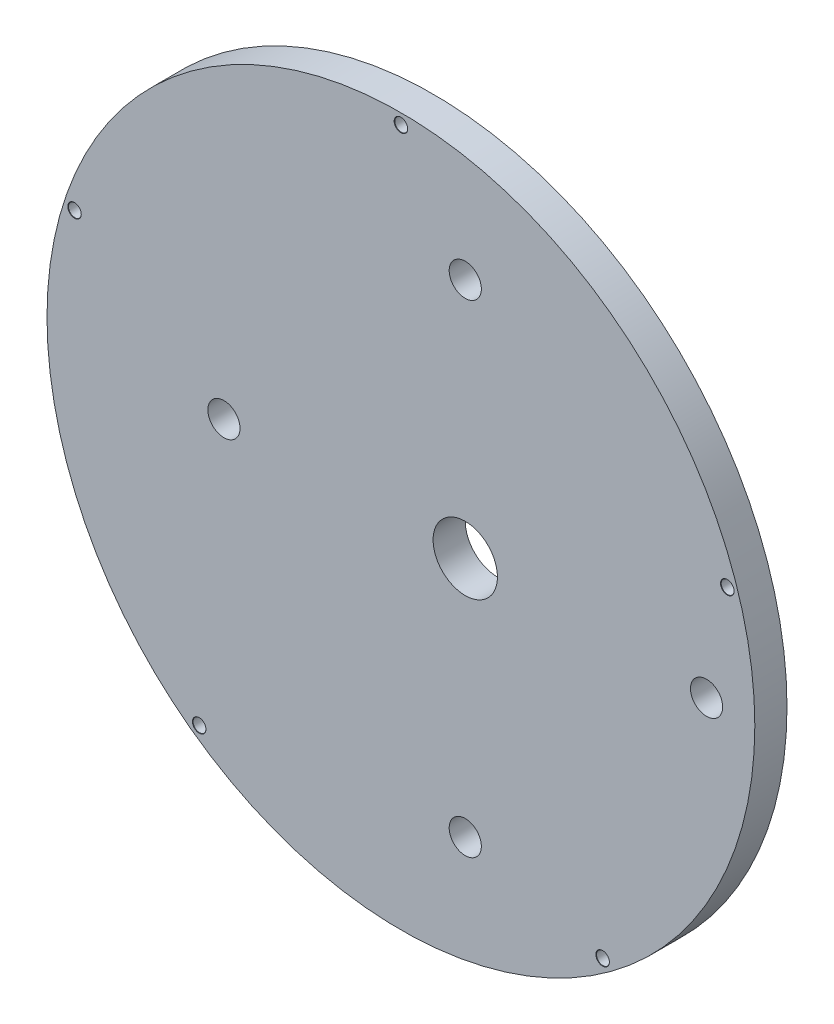
ISO-10303-21;
HEADER;
FILE_DESCRIPTION(('STEP AP214'),'2;1');
FILE_NAME('part.step','',(''),(''),'','','');
FILE_SCHEMA(('AUTOMOTIVE_DESIGN { 1 0 10303 214 1 1 1 1 }'));
ENDSEC;
DATA;
#1=APPLICATION_CONTEXT('core data for automotive mechanical design processes');
#2=APPLICATION_PROTOCOL_DEFINITION('international standard','automotive_design',2000,#1);
#3=PRODUCT_CONTEXT('',#1,'mechanical');
#4=PRODUCT('Part','Part','',(#3));
#5=PRODUCT_RELATED_PRODUCT_CATEGORY('part','',(#4));
#6=PRODUCT_DEFINITION_FORMATION('','',#4);
#7=PRODUCT_DEFINITION_CONTEXT('part definition',#1,'design');
#8=PRODUCT_DEFINITION('design','',#6,#7);
#9=PRODUCT_DEFINITION_SHAPE('','',#8);
#10=(LENGTH_UNIT() NAMED_UNIT(*) SI_UNIT(.MILLI.,.METRE.));
#11=(NAMED_UNIT(*) PLANE_ANGLE_UNIT() SI_UNIT($,.RADIAN.));
#12=(NAMED_UNIT(*) SI_UNIT($,.STERADIAN.) SOLID_ANGLE_UNIT());
#13=UNCERTAINTY_MEASURE_WITH_UNIT(LENGTH_MEASURE(1.E-05),#10,'distance_accuracy_value','');
#14=(GEOMETRIC_REPRESENTATION_CONTEXT(3) GLOBAL_UNCERTAINTY_ASSIGNED_CONTEXT((#13)) GLOBAL_UNIT_ASSIGNED_CONTEXT((#10,
#11,#12)) REPRESENTATION_CONTEXT('',''));
#15=CARTESIAN_POINT('',(0.,0.,0.));
#16=DIRECTION('',(0.,0.,1.));
#17=DIRECTION('',(1.,0.,0.));
#18=AXIS2_PLACEMENT_3D('',#15,#16,#17);
#19=CARTESIAN_POINT('',(0.,0.,1.25));
#20=DIRECTION('',(0.,0.,-1.));
#21=DIRECTION('',(-1.,0.,0.));
#22=AXIS2_PLACEMENT_3D('',#19,#20,#21);
#23=CYLINDRICAL_SURFACE('',#22,27.5);
#24=CARTESIAN_POINT('',(0.,0.,1.25));
#25=DIRECTION('',(0.,0.,1.));
#26=DIRECTION('',(1.,0.,0.));
#27=AXIS2_PLACEMENT_3D('',#24,#25,#26);
#28=CIRCLE('',#27,27.5);
#29=CARTESIAN_POINT('',(27.5,0.,1.25));
#30=VERTEX_POINT('',#29);
#31=EDGE_CURVE('E10',#30,#30,#28,.T.);
#32=ORIENTED_EDGE('',*,*,#31,.F.);
#33=EDGE_LOOP('',(#32));
#34=FACE_BOUND('',#33,.T.);
#35=CARTESIAN_POINT('',(0.,0.,-1.25));
#36=DIRECTION('',(0.,0.,1.));
#37=DIRECTION('',(1.,0.,0.));
#38=AXIS2_PLACEMENT_3D('',#35,#36,#37);
#39=CIRCLE('',#38,27.5);
#40=CARTESIAN_POINT('',(27.5,0.,-1.25));
#41=VERTEX_POINT('',#40);
#42=EDGE_CURVE('E38',#41,#41,#39,.T.);
#43=ORIENTED_EDGE('',*,*,#42,.T.);
#44=EDGE_LOOP('',(#43));
#45=FACE_BOUND('',#44,.T.);
#46=ADVANCED_FACE('F35',(#34,#45),#23,.T.);
#47=CARTESIAN_POINT('',(0.,0.,1.25));
#48=DIRECTION('',(0.,0.,1.));
#49=DIRECTION('',(1.,0.,0.));
#50=AXIS2_PLACEMENT_3D('',#47,#48,#49);
#51=PLANE('',#50);
#52=CARTESIAN_POINT('',(25.361507101204,8.24045318333222,1.25));
#53=DIRECTION('',(0.,0.,1.));
#54=DIRECTION('',(1.,0.,0.));
#55=AXIS2_PLACEMENT_3D('',#52,#53,#54);
#56=CIRCLE('',#55,0.525000000000001);
#57=CARTESIAN_POINT('',(25.886507101204,8.24045318333222,1.25));
#58=VERTEX_POINT('',#57);
#59=EDGE_CURVE('E118',#58,#58,#56,.T.);
#60=ORIENTED_EDGE('',*,*,#59,.F.);
#61=EDGE_LOOP('',(#60));
#62=FACE_BOUND('',#61,.T.);
#63=CARTESIAN_POINT('',(15.6742733944661,-21.5737865166651,1.25));
#64=DIRECTION('',(0.,0.,1.));
#65=DIRECTION('',(1.,0.,0.));
#66=AXIS2_PLACEMENT_3D('',#63,#64,#65);
#67=CIRCLE('',#66,0.525000000000001);
#68=CARTESIAN_POINT('',(16.1992733944661,-21.5737865166651,1.25));
#69=VERTEX_POINT('',#68);
#70=EDGE_CURVE('E109',#69,#69,#67,.T.);
#71=ORIENTED_EDGE('',*,*,#70,.F.);
#72=EDGE_LOOP('',(#71));
#73=FACE_BOUND('',#72,.T.);
#74=CARTESIAN_POINT('',(-15.6742733944658,-21.5737865166654,1.25));
#75=DIRECTION('',(0.,0.,1.));
#76=DIRECTION('',(1.,0.,0.));
#77=AXIS2_PLACEMENT_3D('',#74,#75,#76);
#78=CIRCLE('',#77,0.524999999999999);
#79=CARTESIAN_POINT('',(-15.1492733944658,-21.5737865166654,1.25));
#80=VERTEX_POINT('',#79);
#81=EDGE_CURVE('E100',#80,#80,#78,.T.);
#82=ORIENTED_EDGE('',*,*,#81,.F.);
#83=EDGE_LOOP('',(#82));
#84=FACE_BOUND('',#83,.T.);
#85=CARTESIAN_POINT('',(-25.3615071012041,8.24045318333186,1.25));
#86=DIRECTION('',(0.,0.,1.));
#87=DIRECTION('',(1.,0.,0.));
#88=AXIS2_PLACEMENT_3D('',#85,#86,#87);
#89=CIRCLE('',#88,0.524999999999998);
#90=CARTESIAN_POINT('',(-24.8365071012041,8.24045318333186,1.25));
#91=VERTEX_POINT('',#90);
#92=EDGE_CURVE('E91',#91,#91,#89,.T.);
#93=ORIENTED_EDGE('',*,*,#92,.F.);
#94=EDGE_LOOP('',(#93));
#95=FACE_BOUND('',#94,.T.);
#96=CARTESIAN_POINT('',(0.,26.6666666666667,1.25));
#97=DIRECTION('',(0.,0.,1.));
#98=DIRECTION('',(1.,0.,0.));
#99=AXIS2_PLACEMENT_3D('',#96,#97,#98);
#100=CIRCLE('',#99,0.524999999999999);
#101=CARTESIAN_POINT('',(0.525,26.6666666666667,1.25));
#102=VERTEX_POINT('',#101);
#103=EDGE_CURVE('E82',#102,#102,#100,.T.);
#104=ORIENTED_EDGE('',*,*,#103,.F.);
#105=EDGE_LOOP('',(#104));
#106=FACE_BOUND('',#105,.T.);
#107=CARTESIAN_POINT('',(5.,18.75,1.25));
#108=DIRECTION('',(0.,0.,1.));
#109=DIRECTION('',(1.,0.,0.));
#110=AXIS2_PLACEMENT_3D('',#107,#108,#109);
#111=CIRCLE('',#110,1.25);
#112=CARTESIAN_POINT('',(6.25,18.75,1.25));
#113=VERTEX_POINT('',#112);
#114=EDGE_CURVE('E45',#113,#113,#111,.T.);
#115=ORIENTED_EDGE('',*,*,#114,.F.);
#116=EDGE_LOOP('',(#115));
#117=FACE_BOUND('',#116,.T.);
#118=CARTESIAN_POINT('',(-13.75,0.,1.25));
#119=DIRECTION('',(0.,0.,1.));
#120=DIRECTION('',(1.,0.,0.));
#121=AXIS2_PLACEMENT_3D('',#118,#119,#120);
#122=CIRCLE('',#121,1.25);
#123=CARTESIAN_POINT('',(-12.5,0.,1.25));
#124=VERTEX_POINT('',#123);
#125=EDGE_CURVE('E49',#124,#124,#122,.T.);
#126=ORIENTED_EDGE('',*,*,#125,.F.);
#127=EDGE_LOOP('',(#126));
#128=FACE_BOUND('',#127,.T.);
#129=CARTESIAN_POINT('',(23.75,0.,1.25));
#130=DIRECTION('',(0.,0.,1.));
#131=DIRECTION('',(1.,0.,0.));
#132=AXIS2_PLACEMENT_3D('',#129,#130,#131);
#133=CIRCLE('',#132,1.25);
#134=CARTESIAN_POINT('',(25.,0.,1.25));
#135=VERTEX_POINT('',#134);
#136=EDGE_CURVE('E52',#135,#135,#133,.T.);
#137=ORIENTED_EDGE('',*,*,#136,.F.);
#138=EDGE_LOOP('',(#137));
#139=FACE_BOUND('',#138,.T.);
#140=CARTESIAN_POINT('',(5.,-18.75,1.25));
#141=DIRECTION('',(0.,0.,1.));
#142=DIRECTION('',(1.,0.,0.));
#143=AXIS2_PLACEMENT_3D('',#140,#141,#142);
#144=CIRCLE('',#143,1.25);
#145=CARTESIAN_POINT('',(6.25,-18.75,1.25));
#146=VERTEX_POINT('',#145);
#147=EDGE_CURVE('E55',#146,#146,#144,.T.);
#148=ORIENTED_EDGE('',*,*,#147,.F.);
#149=EDGE_LOOP('',(#148));
#150=FACE_BOUND('',#149,.T.);
#151=CARTESIAN_POINT('',(5.,0.,1.25));
#152=DIRECTION('',(0.,0.,1.));
#153=DIRECTION('',(1.,0.,0.));
#154=AXIS2_PLACEMENT_3D('',#151,#152,#153);
#155=CIRCLE('',#154,2.5);
#156=CARTESIAN_POINT('',(7.5,0.,1.25));
#157=VERTEX_POINT('',#156);
#158=EDGE_CURVE('E58',#157,#157,#155,.T.);
#159=ORIENTED_EDGE('',*,*,#158,.F.);
#160=EDGE_LOOP('',(#159));
#161=FACE_BOUND('',#160,.T.);
#162=ORIENTED_EDGE('',*,*,#31,.T.);
#163=EDGE_LOOP('',(#162));
#164=FACE_BOUND('',#163,.T.);
#165=ADVANCED_FACE('F124',(#62,#73,#84,#95,#106,#117,#128,#139,#150,#161,#164),#51,.T.);
#166=CARTESIAN_POINT('',(0.,0.,-1.25));
#167=DIRECTION('',(0.,0.,1.));
#168=DIRECTION('',(1.,0.,0.));
#169=AXIS2_PLACEMENT_3D('',#166,#167,#168);
#170=PLANE('',#169);
#171=CARTESIAN_POINT('',(25.361507101204,8.24045318333222,-1.25));
#172=DIRECTION('',(0.,0.,1.));
#173=DIRECTION('',(1.,0.,0.));
#174=AXIS2_PLACEMENT_3D('',#171,#172,#173);
#175=CIRCLE('',#174,0.5);
#176=CARTESIAN_POINT('',(25.861507101204,8.24045318333222,-1.25));
#177=VERTEX_POINT('',#176);
#178=EDGE_CURVE('E112',#177,#177,#175,.T.);
#179=ORIENTED_EDGE('',*,*,#178,.T.);
#180=EDGE_LOOP('',(#179));
#181=FACE_BOUND('',#180,.T.);
#182=CARTESIAN_POINT('',(15.6742733944661,-21.5737865166651,-1.25));
#183=DIRECTION('',(0.,0.,1.));
#184=DIRECTION('',(1.,0.,0.));
#185=AXIS2_PLACEMENT_3D('',#182,#183,#184);
#186=CIRCLE('',#185,0.5);
#187=CARTESIAN_POINT('',(16.1742733944661,-21.5737865166651,-1.25));
#188=VERTEX_POINT('',#187);
#189=EDGE_CURVE('E103',#188,#188,#186,.T.);
#190=ORIENTED_EDGE('',*,*,#189,.T.);
#191=EDGE_LOOP('',(#190));
#192=FACE_BOUND('',#191,.T.);
#193=CARTESIAN_POINT('',(-15.6742733944658,-21.5737865166654,-1.25));
#194=DIRECTION('',(0.,0.,1.));
#195=DIRECTION('',(1.,0.,0.));
#196=AXIS2_PLACEMENT_3D('',#193,#194,#195);
#197=CIRCLE('',#196,0.5);
#198=CARTESIAN_POINT('',(-15.1742733944658,-21.5737865166654,-1.25));
#199=VERTEX_POINT('',#198);
#200=EDGE_CURVE('E94',#199,#199,#197,.T.);
#201=ORIENTED_EDGE('',*,*,#200,.T.);
#202=EDGE_LOOP('',(#201));
#203=FACE_BOUND('',#202,.T.);
#204=CARTESIAN_POINT('',(-25.3615071012041,8.24045318333186,-1.25));
#205=DIRECTION('',(0.,0.,1.));
#206=DIRECTION('',(1.,0.,0.));
#207=AXIS2_PLACEMENT_3D('',#204,#205,#206);
#208=CIRCLE('',#207,0.5);
#209=CARTESIAN_POINT('',(-24.8615071012041,8.24045318333186,-1.25));
#210=VERTEX_POINT('',#209);
#211=EDGE_CURVE('E85',#210,#210,#208,.T.);
#212=ORIENTED_EDGE('',*,*,#211,.T.);
#213=EDGE_LOOP('',(#212));
#214=FACE_BOUND('',#213,.T.);
#215=CARTESIAN_POINT('',(0.,26.6666666666667,-1.25));
#216=DIRECTION('',(0.,0.,1.));
#217=DIRECTION('',(1.,0.,0.));
#218=AXIS2_PLACEMENT_3D('',#215,#216,#217);
#219=CIRCLE('',#218,0.5);
#220=CARTESIAN_POINT('',(0.5,26.6666666666667,-1.25));
#221=VERTEX_POINT('',#220);
#222=EDGE_CURVE('E74',#221,#221,#219,.T.);
#223=ORIENTED_EDGE('',*,*,#222,.T.);
#224=EDGE_LOOP('',(#223));
#225=FACE_BOUND('',#224,.T.);
#226=CARTESIAN_POINT('',(5.,18.75,-1.25));
#227=DIRECTION('',(0.,0.,1.));
#228=DIRECTION('',(1.,0.,0.));
#229=AXIS2_PLACEMENT_3D('',#226,#227,#228);
#230=CIRCLE('',#229,1.25);
#231=CARTESIAN_POINT('',(6.25,18.75,-1.25));
#232=VERTEX_POINT('',#231);
#233=EDGE_CURVE('E64',#232,#232,#230,.T.);
#234=ORIENTED_EDGE('',*,*,#233,.T.);
#235=EDGE_LOOP('',(#234));
#236=FACE_BOUND('',#235,.T.);
#237=CARTESIAN_POINT('',(-13.75,0.,-1.25));
#238=DIRECTION('',(0.,0.,1.));
#239=DIRECTION('',(1.,0.,0.));
#240=AXIS2_PLACEMENT_3D('',#237,#238,#239);
#241=CIRCLE('',#240,1.25);
#242=CARTESIAN_POINT('',(-12.5,0.,-1.25));
#243=VERTEX_POINT('',#242);
#244=EDGE_CURVE('E65',#243,#243,#241,.T.);
#245=ORIENTED_EDGE('',*,*,#244,.T.);
#246=EDGE_LOOP('',(#245));
#247=FACE_BOUND('',#246,.T.);
#248=CARTESIAN_POINT('',(23.75,0.,-1.25));
#249=DIRECTION('',(0.,0.,1.));
#250=DIRECTION('',(1.,0.,0.));
#251=AXIS2_PLACEMENT_3D('',#248,#249,#250);
#252=CIRCLE('',#251,1.25);
#253=CARTESIAN_POINT('',(25.,0.,-1.25));
#254=VERTEX_POINT('',#253);
#255=EDGE_CURVE('E68',#254,#254,#252,.T.);
#256=ORIENTED_EDGE('',*,*,#255,.T.);
#257=EDGE_LOOP('',(#256));
#258=FACE_BOUND('',#257,.T.);
#259=CARTESIAN_POINT('',(5.,-18.75,-1.25));
#260=DIRECTION('',(0.,0.,1.));
#261=DIRECTION('',(1.,0.,0.));
#262=AXIS2_PLACEMENT_3D('',#259,#260,#261);
#263=CIRCLE('',#262,1.25);
#264=CARTESIAN_POINT('',(6.25,-18.75,-1.25));
#265=VERTEX_POINT('',#264);
#266=EDGE_CURVE('E71',#265,#265,#263,.T.);
#267=ORIENTED_EDGE('',*,*,#266,.T.);
#268=EDGE_LOOP('',(#267));
#269=FACE_BOUND('',#268,.T.);
#270=CARTESIAN_POINT('',(5.,0.,-1.25));
#271=DIRECTION('',(0.,0.,1.));
#272=DIRECTION('',(1.,0.,0.));
#273=AXIS2_PLACEMENT_3D('',#270,#271,#272);
#274=CIRCLE('',#273,2.5);
#275=CARTESIAN_POINT('',(7.5,0.,-1.25));
#276=VERTEX_POINT('',#275);
#277=EDGE_CURVE('E61',#276,#276,#274,.T.);
#278=ORIENTED_EDGE('',*,*,#277,.T.);
#279=EDGE_LOOP('',(#278));
#280=FACE_BOUND('',#279,.T.);
#281=ORIENTED_EDGE('',*,*,#42,.F.);
#282=EDGE_LOOP('',(#281));
#283=FACE_BOUND('',#282,.T.);
#284=ADVANCED_FACE('F127',(#181,#192,#203,#214,#225,#236,#247,#258,#269,#280,#283),#170,.F.);
#285=CARTESIAN_POINT('',(5.,0.,-1.25));
#286=DIRECTION('',(0.,0.,1.));
#287=DIRECTION('',(1.,0.,0.));
#288=AXIS2_PLACEMENT_3D('',#285,#286,#287);
#289=CYLINDRICAL_SURFACE('',#288,2.5);
#290=ORIENTED_EDGE('',*,*,#158,.T.);
#291=EDGE_LOOP('',(#290));
#292=FACE_BOUND('',#291,.T.);
#293=ORIENTED_EDGE('',*,*,#277,.F.);
#294=EDGE_LOOP('',(#293));
#295=FACE_BOUND('',#294,.T.);
#296=ADVANCED_FACE('F147',(#292,#295),#289,.F.);
#297=CARTESIAN_POINT('',(5.,-18.75,-1.25));
#298=DIRECTION('',(0.,0.,1.));
#299=DIRECTION('',(1.,0.,0.));
#300=AXIS2_PLACEMENT_3D('',#297,#298,#299);
#301=CYLINDRICAL_SURFACE('',#300,1.25);
#302=ORIENTED_EDGE('',*,*,#147,.T.);
#303=EDGE_LOOP('',(#302));
#304=FACE_BOUND('',#303,.T.);
#305=ORIENTED_EDGE('',*,*,#266,.F.);
#306=EDGE_LOOP('',(#305));
#307=FACE_BOUND('',#306,.T.);
#308=ADVANCED_FACE('F150',(#304,#307),#301,.F.);
#309=CARTESIAN_POINT('',(23.75,0.,-1.25));
#310=DIRECTION('',(0.,0.,1.));
#311=DIRECTION('',(1.,0.,0.));
#312=AXIS2_PLACEMENT_3D('',#309,#310,#311);
#313=CYLINDRICAL_SURFACE('',#312,1.25);
#314=ORIENTED_EDGE('',*,*,#136,.T.);
#315=EDGE_LOOP('',(#314));
#316=FACE_BOUND('',#315,.T.);
#317=ORIENTED_EDGE('',*,*,#255,.F.);
#318=EDGE_LOOP('',(#317));
#319=FACE_BOUND('',#318,.T.);
#320=ADVANCED_FACE('F183',(#316,#319),#313,.F.);
#321=CARTESIAN_POINT('',(-13.75,0.,-1.25));
#322=DIRECTION('',(0.,0.,1.));
#323=DIRECTION('',(1.,0.,0.));
#324=AXIS2_PLACEMENT_3D('',#321,#322,#323);
#325=CYLINDRICAL_SURFACE('',#324,1.25);
#326=ORIENTED_EDGE('',*,*,#125,.T.);
#327=EDGE_LOOP('',(#326));
#328=FACE_BOUND('',#327,.T.);
#329=ORIENTED_EDGE('',*,*,#244,.F.);
#330=EDGE_LOOP('',(#329));
#331=FACE_BOUND('',#330,.T.);
#332=ADVANCED_FACE('F191',(#328,#331),#325,.F.);
#333=CARTESIAN_POINT('',(5.,18.75,-1.25));
#334=DIRECTION('',(0.,0.,1.));
#335=DIRECTION('',(1.,0.,0.));
#336=AXIS2_PLACEMENT_3D('',#333,#334,#335);
#337=CYLINDRICAL_SURFACE('',#336,1.25);
#338=ORIENTED_EDGE('',*,*,#114,.T.);
#339=EDGE_LOOP('',(#338));
#340=FACE_BOUND('',#339,.T.);
#341=ORIENTED_EDGE('',*,*,#233,.F.);
#342=EDGE_LOOP('',(#341));
#343=FACE_BOUND('',#342,.T.);
#344=ADVANCED_FACE('F199',(#340,#343),#337,.F.);
#345=CARTESIAN_POINT('',(0.,26.6666666666667,1.25));
#346=DIRECTION('',(0.,0.,1.));
#347=DIRECTION('',(1.,0.,0.));
#348=AXIS2_PLACEMENT_3D('',#345,#346,#347);
#349=CYLINDRICAL_SURFACE('',#348,0.5);
#350=ORIENTED_EDGE('',*,*,#222,.F.);
#351=EDGE_LOOP('',(#350));
#352=FACE_BOUND('',#351,.T.);
#353=CARTESIAN_POINT('',(0.,26.6666666666667,1.225));
#354=DIRECTION('',(0.,0.,1.));
#355=DIRECTION('',(1.,0.,0.));
#356=AXIS2_PLACEMENT_3D('',#353,#354,#355);
#357=CIRCLE('',#356,0.5);
#358=CARTESIAN_POINT('',(0.5,26.6666666666667,1.225));
#359=VERTEX_POINT('',#358);
#360=EDGE_CURVE('E79',#359,#359,#357,.T.);
#361=ORIENTED_EDGE('',*,*,#360,.T.);
#362=EDGE_LOOP('',(#361));
#363=FACE_BOUND('',#362,.T.);
#364=ADVANCED_FACE('F207',(#352,#363),#349,.F.);
#365=CARTESIAN_POINT('',(0.,26.6666666666667,1.25));
#366=DIRECTION('',(0.,0.,1.));
#367=DIRECTION('',(1.,0.,0.));
#368=AXIS2_PLACEMENT_3D('',#365,#366,#367);
#369=CONICAL_SURFACE('',#368,0.524999999999999,0.785398163397396);
#370=ORIENTED_EDGE('',*,*,#360,.F.);
#371=EDGE_LOOP('',(#370));
#372=FACE_BOUND('',#371,.T.);
#373=ORIENTED_EDGE('',*,*,#103,.T.);
#374=EDGE_LOOP('',(#373));
#375=FACE_BOUND('',#374,.T.);
#376=ADVANCED_FACE('F215',(#372,#375),#369,.F.);
#377=CARTESIAN_POINT('',(-25.3615071012041,8.24045318333186,1.25));
#378=DIRECTION('',(0.,0.,1.));
#379=DIRECTION('',(1.,0.,0.));
#380=AXIS2_PLACEMENT_3D('',#377,#378,#379);
#381=CYLINDRICAL_SURFACE('',#380,0.5);
#382=ORIENTED_EDGE('',*,*,#211,.F.);
#383=EDGE_LOOP('',(#382));
#384=FACE_BOUND('',#383,.T.);
#385=CARTESIAN_POINT('',(-25.3615071012041,8.24045318333186,1.225));
#386=DIRECTION('',(0.,0.,1.));
#387=DIRECTION('',(1.,0.,0.));
#388=AXIS2_PLACEMENT_3D('',#385,#386,#387);
#389=CIRCLE('',#388,0.5);
#390=CARTESIAN_POINT('',(-24.8615071012041,8.24045318333186,1.225));
#391=VERTEX_POINT('',#390);
#392=EDGE_CURVE('E88',#391,#391,#389,.T.);
#393=ORIENTED_EDGE('',*,*,#392,.T.);
#394=EDGE_LOOP('',(#393));
#395=FACE_BOUND('',#394,.T.);
#396=ADVANCED_FACE('F222',(#384,#395),#381,.F.);
#397=CARTESIAN_POINT('',(-25.3615071012041,8.24045318333186,1.25));
#398=DIRECTION('',(0.,0.,1.));
#399=DIRECTION('',(1.,0.,0.));
#400=AXIS2_PLACEMENT_3D('',#397,#398,#399);
#401=CONICAL_SURFACE('',#400,0.524999999999998,0.785398163397353);
#402=ORIENTED_EDGE('',*,*,#392,.F.);
#403=EDGE_LOOP('',(#402));
#404=FACE_BOUND('',#403,.T.);
#405=ORIENTED_EDGE('',*,*,#92,.T.);
#406=EDGE_LOOP('',(#405));
#407=FACE_BOUND('',#406,.T.);
#408=ADVANCED_FACE('F229',(#404,#407),#401,.F.);
#409=CARTESIAN_POINT('',(-15.6742733944658,-21.5737865166654,1.25));
#410=DIRECTION('',(0.,0.,1.));
#411=DIRECTION('',(1.,0.,0.));
#412=AXIS2_PLACEMENT_3D('',#409,#410,#411);
#413=CYLINDRICAL_SURFACE('',#412,0.5);
#414=ORIENTED_EDGE('',*,*,#200,.F.);
#415=EDGE_LOOP('',(#414));
#416=FACE_BOUND('',#415,.T.);
#417=CARTESIAN_POINT('',(-15.6742733944658,-21.5737865166654,1.225));
#418=DIRECTION('',(0.,0.,1.));
#419=DIRECTION('',(1.,0.,0.));
#420=AXIS2_PLACEMENT_3D('',#417,#418,#419);
#421=CIRCLE('',#420,0.5);
#422=CARTESIAN_POINT('',(-15.1742733944658,-21.5737865166654,1.225));
#423=VERTEX_POINT('',#422);
#424=EDGE_CURVE('E97',#423,#423,#421,.T.);
#425=ORIENTED_EDGE('',*,*,#424,.T.);
#426=EDGE_LOOP('',(#425));
#427=FACE_BOUND('',#426,.T.);
#428=ADVANCED_FACE('F237',(#416,#427),#413,.F.);
#429=CARTESIAN_POINT('',(-15.6742733944658,-21.5737865166654,1.25));
#430=DIRECTION('',(0.,0.,1.));
#431=DIRECTION('',(1.,0.,0.));
#432=AXIS2_PLACEMENT_3D('',#429,#430,#431);
#433=CONICAL_SURFACE('',#432,0.524999999999999,0.785398163397388);
#434=ORIENTED_EDGE('',*,*,#424,.F.);
#435=EDGE_LOOP('',(#434));
#436=FACE_BOUND('',#435,.T.);
#437=ORIENTED_EDGE('',*,*,#81,.T.);
#438=EDGE_LOOP('',(#437));
#439=FACE_BOUND('',#438,.T.);
#440=ADVANCED_FACE('F245',(#436,#439),#433,.F.);
#441=CARTESIAN_POINT('',(15.6742733944661,-21.5737865166651,1.25));
#442=DIRECTION('',(0.,0.,1.));
#443=DIRECTION('',(1.,0.,0.));
#444=AXIS2_PLACEMENT_3D('',#441,#442,#443);
#445=CYLINDRICAL_SURFACE('',#444,0.5);
#446=ORIENTED_EDGE('',*,*,#189,.F.);
#447=EDGE_LOOP('',(#446));
#448=FACE_BOUND('',#447,.T.);
#449=CARTESIAN_POINT('',(15.6742733944661,-21.5737865166651,1.225));
#450=DIRECTION('',(0.,0.,1.));
#451=DIRECTION('',(1.,0.,0.));
#452=AXIS2_PLACEMENT_3D('',#449,#450,#451);
#453=CIRCLE('',#452,0.5);
#454=CARTESIAN_POINT('',(16.1742733944661,-21.5737865166651,1.225));
#455=VERTEX_POINT('',#454);
#456=EDGE_CURVE('E106',#455,#455,#453,.T.);
#457=ORIENTED_EDGE('',*,*,#456,.T.);
#458=EDGE_LOOP('',(#457));
#459=FACE_BOUND('',#458,.T.);
#460=ADVANCED_FACE('F253',(#448,#459),#445,.F.);
#461=CARTESIAN_POINT('',(15.6742733944661,-21.5737865166651,1.25));
#462=DIRECTION('',(0.,0.,1.));
#463=DIRECTION('',(1.,0.,0.));
#464=AXIS2_PLACEMENT_3D('',#461,#462,#463);
#465=CONICAL_SURFACE('',#464,0.525000000000001,0.785398163397422);
#466=ORIENTED_EDGE('',*,*,#456,.F.);
#467=EDGE_LOOP('',(#466));
#468=FACE_BOUND('',#467,.T.);
#469=ORIENTED_EDGE('',*,*,#70,.T.);
#470=EDGE_LOOP('',(#469));
#471=FACE_BOUND('',#470,.T.);
#472=ADVANCED_FACE('F261',(#468,#471),#465,.F.);
#473=CARTESIAN_POINT('',(25.361507101204,8.24045318333222,1.25));
#474=DIRECTION('',(0.,0.,1.));
#475=DIRECTION('',(1.,0.,0.));
#476=AXIS2_PLACEMENT_3D('',#473,#474,#475);
#477=CYLINDRICAL_SURFACE('',#476,0.5);
#478=ORIENTED_EDGE('',*,*,#178,.F.);
#479=EDGE_LOOP('',(#478));
#480=FACE_BOUND('',#479,.T.);
#481=CARTESIAN_POINT('',(25.361507101204,8.24045318333222,1.225));
#482=DIRECTION('',(0.,0.,1.));
#483=DIRECTION('',(1.,0.,0.));
#484=AXIS2_PLACEMENT_3D('',#481,#482,#483);
#485=CIRCLE('',#484,0.5);
#486=CARTESIAN_POINT('',(25.861507101204,8.24045318333222,1.225));
#487=VERTEX_POINT('',#486);
#488=EDGE_CURVE('E115',#487,#487,#485,.T.);
#489=ORIENTED_EDGE('',*,*,#488,.T.);
#490=EDGE_LOOP('',(#489));
#491=FACE_BOUND('',#490,.T.);
#492=ADVANCED_FACE('F269',(#480,#491),#477,.F.);
#493=CARTESIAN_POINT('',(25.361507101204,8.24045318333222,1.25));
#494=DIRECTION('',(0.,0.,1.));
#495=DIRECTION('',(1.,0.,0.));
#496=AXIS2_PLACEMENT_3D('',#493,#494,#495);
#497=CONICAL_SURFACE('',#496,0.525000000000001,0.785398163397422);
#498=ORIENTED_EDGE('',*,*,#488,.F.);
#499=EDGE_LOOP('',(#498));
#500=FACE_BOUND('',#499,.T.);
#501=ORIENTED_EDGE('',*,*,#59,.T.);
#502=EDGE_LOOP('',(#501));
#503=FACE_BOUND('',#502,.T.);
#504=ADVANCED_FACE('F122',(#500,#503),#497,.F.);
#505=CLOSED_SHELL('',(#46,#165,#284,#296,#308,#320,#332,#344,#364,#376,#396,#408,#428,#440,#460,
#472,#492,#504));
#506=MANIFOLD_SOLID_BREP('B2',#505);
#507=ADVANCED_BREP_SHAPE_REPRESENTATION('',(#18,#506),#14);
#508=SHAPE_DEFINITION_REPRESENTATION(#9,#507);
ENDSEC;
END-ISO-10303-21;
